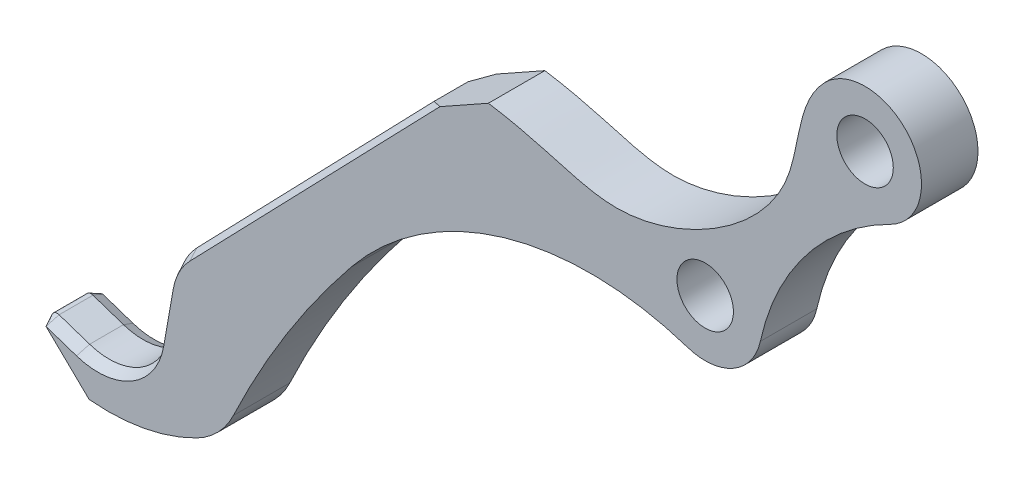
ISO-10303-21;
HEADER;
FILE_DESCRIPTION(('STEP AP214'),'2;1');
FILE_NAME('part.step','',(''),(''),'','','');
FILE_SCHEMA(('AUTOMOTIVE_DESIGN { 1 0 10303 214 1 1 1 1 }'));
ENDSEC;
DATA;
#1=APPLICATION_CONTEXT('core data for automotive mechanical design processes');
#2=APPLICATION_PROTOCOL_DEFINITION('international standard','automotive_design',2000,#1);
#3=PRODUCT_CONTEXT('',#1,'mechanical');
#4=PRODUCT('Part','Part','',(#3));
#5=PRODUCT_RELATED_PRODUCT_CATEGORY('part','',(#4));
#6=PRODUCT_DEFINITION_FORMATION('','',#4);
#7=PRODUCT_DEFINITION_CONTEXT('part definition',#1,'design');
#8=PRODUCT_DEFINITION('design','',#6,#7);
#9=PRODUCT_DEFINITION_SHAPE('','',#8);
#10=(LENGTH_UNIT() NAMED_UNIT(*) SI_UNIT(.MILLI.,.METRE.));
#11=(NAMED_UNIT(*) PLANE_ANGLE_UNIT() SI_UNIT($,.RADIAN.));
#12=(NAMED_UNIT(*) SI_UNIT($,.STERADIAN.) SOLID_ANGLE_UNIT());
#13=UNCERTAINTY_MEASURE_WITH_UNIT(LENGTH_MEASURE(1.E-05),#10,'distance_accuracy_value','');
#14=(GEOMETRIC_REPRESENTATION_CONTEXT(3) GLOBAL_UNCERTAINTY_ASSIGNED_CONTEXT((#13)) GLOBAL_UNIT_ASSIGNED_CONTEXT((#10,
#11,#12)) REPRESENTATION_CONTEXT('',''));
#15=CARTESIAN_POINT('',(0.,0.,0.));
#16=DIRECTION('',(0.,0.,1.));
#17=DIRECTION('',(1.,0.,0.));
#18=AXIS2_PLACEMENT_3D('',#15,#16,#17);
#19=CARTESIAN_POINT('',(35.6569767441861,18.1267760361454,2.5));
#20=DIRECTION('',(0.,0.,1.));
#21=DIRECTION('',(1.,0.,0.));
#22=AXIS2_PLACEMENT_3D('',#19,#20,#21);
#23=PLANE('',#22);
#24=CARTESIAN_POINT('',(21.5,0.,2.5));
#25=DIRECTION('',(0.,0.,1.));
#26=DIRECTION('',(1.,0.,0.));
#27=AXIS2_PLACEMENT_3D('',#24,#25,#26);
#28=CIRCLE('',#27,2.5);
#29=CARTESIAN_POINT('',(24.,0.,2.5));
#30=VERTEX_POINT('',#29);
#31=EDGE_CURVE('E436',#30,#30,#28,.T.);
#32=ORIENTED_EDGE('',*,*,#31,.F.);
#33=EDGE_LOOP('',(#32));
#34=FACE_BOUND('',#33,.T.);
#35=CARTESIAN_POINT('',(35.6569767441861,18.1267760361454,2.5));
#36=DIRECTION('',(0.,0.,1.));
#37=DIRECTION('',(1.,0.,0.));
#38=AXIS2_PLACEMENT_3D('',#35,#36,#37);
#39=CIRCLE('',#38,2.5);
#40=CARTESIAN_POINT('',(38.1569767441861,18.1267760361454,2.5));
#41=VERTEX_POINT('',#40);
#42=EDGE_CURVE('E442',#41,#41,#39,.T.);
#43=ORIENTED_EDGE('',*,*,#42,.F.);
#44=EDGE_LOOP('',(#43));
#45=FACE_BOUND('',#44,.T.);
#46=DIRECTION('',(-0.947903464475991,0.318557721668168,0.));
#47=VECTOR('',#46,1.);
#48=CARTESIAN_POINT('',(13.2966588819159,-48.4088039442666,2.5));
#49=LINE('',#48,#47);
#50=CARTESIAN_POINT('',(-34.1642194941211,-32.4588366211718,2.5));
#51=VERTEX_POINT('',#50);
#52=CARTESIAN_POINT('',(-36.8665647570863,-31.5506714098474,2.5));
#53=VERTEX_POINT('',#52);
#54=EDGE_CURVE('E425',#51,#53,#49,.T.);
#55=ORIENTED_EDGE('',*,*,#54,.T.);
#56=DIRECTION('',(0.719117891816846,-0.694888090032413,0.));
#57=VECTOR('',#56,1.);
#58=CARTESIAN_POINT('',(-24.1865677320025,-43.8034313740248,2.5));
#59=LINE('',#58,#57);
#60=CARTESIAN_POINT('',(-33.0505496340555,-35.2381105495942,2.5));
#61=VERTEX_POINT('',#60);
#62=EDGE_CURVE('E422',#53,#61,#59,.T.);
#63=ORIENTED_EDGE('',*,*,#62,.T.);
#64=CARTESIAN_POINT('',(-31.3549129933605,-18.1276992039203,2.5));
#65=DIRECTION('',(0.,0.,1.));
#66=DIRECTION('',(-1.,0.,0.));
#67=AXIS2_PLACEMENT_3D('',#64,#65,#66);
#68=CIRCLE('',#67,17.1942246128004);
#69=CARTESIAN_POINT('',(-23.5206765828774,-33.4334530207075,2.5));
#70=VERTEX_POINT('',#69);
#71=EDGE_CURVE('E483',#61,#70,#68,.T.);
#72=ORIENTED_EDGE('',*,*,#71,.T.);
#73=CARTESIAN_POINT('',(-26.8158115388646,-26.9957452739855,2.5));
#74=DIRECTION('',(0.,0.,1.));
#75=DIRECTION('',(-1.,0.,0.));
#76=AXIS2_PLACEMENT_3D('',#73,#74,#75);
#77=CIRCLE('',#76,7.23201185081802);
#78=CARTESIAN_POINT('',(-20.2786402625582,-30.0888645918599,2.5));
#79=VERTEX_POINT('',#78);
#80=EDGE_CURVE('E224',#70,#79,#77,.T.);
#81=ORIENTED_EDGE('',*,*,#80,.T.);
#82=CARTESIAN_POINT('',(54.3335205851231,-65.3922559689176,2.5));
#83=DIRECTION('',(0.,0.,-1.));
#84=DIRECTION('',(1.,0.,0.));
#85=AXIS2_PLACEMENT_3D('',#82,#83,#84);
#86=CIRCLE('',#85,82.5427403778307);
#87=CARTESIAN_POINT('',(-9.85122890348396,-13.4921411119471,2.5));
#88=VERTEX_POINT('',#87);
#89=EDGE_CURVE('E219',#79,#88,#86,.T.);
#90=ORIENTED_EDGE('',*,*,#89,.T.);
#91=CARTESIAN_POINT('',(11.3596678332938,-30.6433800842752,2.5));
#92=DIRECTION('',(0.,0.,-1.));
#93=DIRECTION('',(1.,0.,0.));
#94=AXIS2_PLACEMENT_3D('',#91,#92,#93);
#95=CIRCLE('',#94,27.2775940776337);
#96=CARTESIAN_POINT('',(19.9291995025533,-4.74685009213697,2.5));
#97=VERTEX_POINT('',#96);
#98=EDGE_CURVE('E385',#88,#97,#95,.T.);
#99=ORIENTED_EDGE('',*,*,#98,.T.);
#100=CARTESIAN_POINT('',(21.5,0.,2.5));
#101=DIRECTION('',(0.,0.,1.));
#102=DIRECTION('',(1.,0.,0.));
#103=AXIS2_PLACEMENT_3D('',#100,#101,#102);
#104=CIRCLE('',#103,5.);
#105=CARTESIAN_POINT('',(26.3838947978595,-1.07124768538378,2.5));
#106=VERTEX_POINT('',#105);
#107=EDGE_CURVE('E209',#97,#106,#104,.T.);
#108=ORIENTED_EDGE('',*,*,#107,.T.);
#109=CARTESIAN_POINT('',(47.4797739300382,-5.6984791526518,2.5));
#110=DIRECTION('',(0.,0.,-1.));
#111=DIRECTION('',(1.,0.,0.));
#112=AXIS2_PLACEMENT_3D('',#109,#110,#111);
#113=CIRCLE('',#112,21.5973930697935);
#114=CARTESIAN_POINT('',(37.8795248628735,13.6479056584588,2.5));
#115=VERTEX_POINT('',#114);
#116=EDGE_CURVE('E493',#106,#115,#113,.T.);
#117=ORIENTED_EDGE('',*,*,#116,.T.);
#118=CARTESIAN_POINT('',(35.6569767441861,18.1267760361454,2.5));
#119=DIRECTION('',(0.,0.,1.));
#120=DIRECTION('',(1.,0.,0.));
#121=AXIS2_PLACEMENT_3D('',#118,#119,#120);
#122=CIRCLE('',#121,5.00000000000001);
#123=CARTESIAN_POINT('',(32.0722231070795,21.6123952582136,2.5));
#124=VERTEX_POINT('',#123);
#125=EDGE_CURVE('E203',#115,#124,#122,.T.);
#126=ORIENTED_EDGE('',*,*,#125,.T.);
#127=CARTESIAN_POINT('',(32.0722231070795,21.6123952582136,2.5));
#128=CARTESIAN_POINT('',(29.6195530579345,19.0899688773774,2.5));
#129=CARTESIAN_POINT('',(30.5294420981265,9.38410746656572,2.5));
#130=CARTESIAN_POINT('',(14.4971164640885,0.221014353395845,2.5));
#131=CARTESIAN_POINT('',(7.89530238424474,4.29096514264077,2.5));
#132=CARTESIAN_POINT('',(2.30349989155702,5.14788877294363,2.5));
#133=B_SPLINE_CURVE_WITH_KNOTS('',3,(#127,#128,#129,#130,#131,#132),.UNSPECIFIED.,.F.,.F.,(4,1,
1,4),(0.,0.241565863797652,0.691252680707342,1.),.UNSPECIFIED.);
#134=CARTESIAN_POINT('',(2.30349989155702,5.14788877294363,2.5));
#135=VERTEX_POINT('',#134);
#136=EDGE_CURVE('E488',#124,#135,#133,.T.);
#137=ORIENTED_EDGE('',*,*,#136,.T.);
#138=DIRECTION('',(-0.872126126619017,-0.489281124986965,0.));
#139=VECTOR('',#138,1.);
#140=CARTESIAN_POINT('',(2.30349989155702,5.14788877294363,2.5));
#141=LINE('',#140,#139);
#142=CARTESIAN_POINT('',(-1.98615701691018,2.74130090231123,2.5));
#143=VERTEX_POINT('',#142);
#144=EDGE_CURVE('E485',#135,#143,#141,.T.);
#145=ORIENTED_EDGE('',*,*,#144,.T.);
#146=DIRECTION('',(-0.694888090032413,-0.719117891816846,0.));
#147=VECTOR('',#146,1.);
#148=CARTESIAN_POINT('',(23.8787838564705,29.5081170553486,2.5));
#149=LINE('',#148,#147);
#150=CARTESIAN_POINT('',(-24.1395370048738,-20.1845372895893,2.5));
#151=VERTEX_POINT('',#150);
#152=EDGE_CURVE('E433',#143,#151,#149,.T.);
#153=ORIENTED_EDGE('',*,*,#152,.T.);
#154=CARTESIAN_POINT('',(-20.1843885998811,-24.0064217847675,2.5));
#155=DIRECTION('',(0.,0.,1.));
#156=DIRECTION('',(1.,0.,0.));
#157=AXIS2_PLACEMENT_3D('',#154,#155,#156);
#158=CIRCLE('',#157,5.49999999999999);
#159=CARTESIAN_POINT('',(-25.6014291423523,-23.0547539008795,2.5));
#160=VERTEX_POINT('',#159);
#161=EDGE_CURVE('E431',#151,#160,#158,.T.);
#162=ORIENTED_EDGE('',*,*,#161,.T.);
#163=DIRECTION('',(-0.173030524343283,-0.98491646226748,0.));
#164=VECTOR('',#163,1.);
#165=CARTESIAN_POINT('',(-16.7491977487089,27.3335140679731,2.5));
#166=LINE('',#165,#164);
#167=CARTESIAN_POINT('',(-26.4476526964072,-27.8715890362437,2.5));
#168=VERTEX_POINT('',#167);
#169=EDGE_CURVE('E429',#160,#168,#166,.T.);
#170=ORIENTED_EDGE('',*,*,#169,.T.);
#171=CARTESIAN_POINT('',(-32.27835787256,-26.8472483814047,2.5));
#172=DIRECTION('',(0.,0.,1.));
#173=DIRECTION('',(1.,0.,0.));
#174=AXIS2_PLACEMENT_3D('',#171,#172,#173);
#175=CIRCLE('',#174,5.91999971523395);
#176=EDGE_CURVE('E427',#168,#51,#175,.F.);
#177=ORIENTED_EDGE('',*,*,#176,.T.);
#178=EDGE_LOOP('',(#55,#63,#72,#81,#90,#99,#108,#117,#126,#137,#145,#153,#162,#170,#177));
#179=FACE_BOUND('',#178,.T.);
#180=ADVANCED_FACE('F36',(#34,#45,#179),#23,.T.);
#181=CARTESIAN_POINT('',(35.6569767441861,18.1267760361454,-2.5));
#182=DIRECTION('',(0.,0.,1.));
#183=DIRECTION('',(1.,0.,0.));
#184=AXIS2_PLACEMENT_3D('',#181,#182,#183);
#185=PLANE('',#184);
#186=CARTESIAN_POINT('',(21.5,0.,-2.5));
#187=DIRECTION('',(0.,0.,1.));
#188=DIRECTION('',(1.,0.,0.));
#189=AXIS2_PLACEMENT_3D('',#186,#187,#188);
#190=CIRCLE('',#189,2.5);
#191=CARTESIAN_POINT('',(24.,0.,-2.5));
#192=VERTEX_POINT('',#191);
#193=EDGE_CURVE('E439',#192,#192,#190,.T.);
#194=ORIENTED_EDGE('',*,*,#193,.T.);
#195=EDGE_LOOP('',(#194));
#196=FACE_BOUND('',#195,.T.);
#197=CARTESIAN_POINT('',(35.6569767441861,18.1267760361454,-2.5));
#198=DIRECTION('',(0.,0.,1.));
#199=DIRECTION('',(1.,0.,0.));
#200=AXIS2_PLACEMENT_3D('',#197,#198,#199);
#201=CIRCLE('',#200,2.5);
#202=CARTESIAN_POINT('',(38.1569767441861,18.1267760361454,-2.5));
#203=VERTEX_POINT('',#202);
#204=EDGE_CURVE('E445',#203,#203,#201,.T.);
#205=ORIENTED_EDGE('',*,*,#204,.T.);
#206=EDGE_LOOP('',(#205));
#207=FACE_BOUND('',#206,.T.);
#208=CARTESIAN_POINT('',(-31.3549129933605,-18.1276992039203,-2.5));
#209=DIRECTION('',(0.,0.,1.));
#210=DIRECTION('',(-1.,0.,0.));
#211=AXIS2_PLACEMENT_3D('',#208,#209,#210);
#212=CIRCLE('',#211,17.1942246128004);
#213=CARTESIAN_POINT('',(-33.0505496340555,-35.2381105495942,-2.5));
#214=VERTEX_POINT('',#213);
#215=CARTESIAN_POINT('',(-23.5206765828774,-33.4334530207075,-2.5));
#216=VERTEX_POINT('',#215);
#217=EDGE_CURVE('E503',#214,#216,#212,.T.);
#218=ORIENTED_EDGE('',*,*,#217,.F.);
#219=DIRECTION('',(-0.719117891816846,0.694888090032413,0.));
#220=VECTOR('',#219,1.);
#221=CARTESIAN_POINT('',(-36.8665647570863,-31.5506714098474,-2.5));
#222=LINE('',#221,#220);
#223=CARTESIAN_POINT('',(-36.8665647570863,-31.5506714098474,-2.5));
#224=VERTEX_POINT('',#223);
#225=EDGE_CURVE('E365',#214,#224,#222,.T.);
#226=ORIENTED_EDGE('',*,*,#225,.T.);
#227=DIRECTION('',(0.947903464475991,-0.318557721668168,0.));
#228=VECTOR('',#227,1.);
#229=CARTESIAN_POINT('',(-34.1642194941211,-32.4588366211718,-2.5));
#230=LINE('',#229,#228);
#231=CARTESIAN_POINT('',(-34.1642194941211,-32.4588366211718,-2.5));
#232=VERTEX_POINT('',#231);
#233=EDGE_CURVE('E367',#224,#232,#230,.T.);
#234=ORIENTED_EDGE('',*,*,#233,.T.);
#235=CARTESIAN_POINT('',(-32.27835787256,-26.8472483814047,-2.5));
#236=DIRECTION('',(0.,0.,1.));
#237=DIRECTION('',(1.,0.,0.));
#238=AXIS2_PLACEMENT_3D('',#235,#236,#237);
#239=CIRCLE('',#238,5.91999971523395);
#240=CARTESIAN_POINT('',(-26.4476526964072,-27.8715890362437,-2.5));
#241=VERTEX_POINT('',#240);
#242=EDGE_CURVE('E369',#232,#241,#239,.T.);
#243=ORIENTED_EDGE('',*,*,#242,.T.);
#244=DIRECTION('',(0.173030524343283,0.98491646226748,0.));
#245=VECTOR('',#244,1.);
#246=CARTESIAN_POINT('',(-25.6014291423523,-23.0547539008795,-2.5));
#247=LINE('',#246,#245);
#248=CARTESIAN_POINT('',(-25.6014291423523,-23.0547539008795,-2.5));
#249=VERTEX_POINT('',#248);
#250=EDGE_CURVE('E371',#241,#249,#247,.T.);
#251=ORIENTED_EDGE('',*,*,#250,.T.);
#252=CARTESIAN_POINT('',(-20.1843885998811,-24.0064217847675,-2.5));
#253=DIRECTION('',(0.,0.,1.));
#254=DIRECTION('',(1.,0.,0.));
#255=AXIS2_PLACEMENT_3D('',#252,#253,#254);
#256=CIRCLE('',#255,5.5);
#257=CARTESIAN_POINT('',(-24.1395370048738,-20.1845372895893,-2.5));
#258=VERTEX_POINT('',#257);
#259=EDGE_CURVE('E331',#249,#258,#256,.F.);
#260=ORIENTED_EDGE('',*,*,#259,.T.);
#261=DIRECTION('',(0.694888090032413,0.719117891816846,0.));
#262=VECTOR('',#261,1.);
#263=CARTESIAN_POINT('',(-3.14510392792002,1.54194309012861,-2.5));
#264=LINE('',#263,#262);
#265=CARTESIAN_POINT('',(-1.98615701691021,2.74130090231121,-2.5));
#266=VERTEX_POINT('',#265);
#267=EDGE_CURVE('E374',#258,#266,#264,.T.);
#268=ORIENTED_EDGE('',*,*,#267,.T.);
#269=DIRECTION('',(-0.872126126619017,-0.489281124986965,0.));
#270=VECTOR('',#269,1.);
#271=CARTESIAN_POINT('',(2.30349989155702,5.14788877294363,-2.5));
#272=LINE('',#271,#270);
#273=CARTESIAN_POINT('',(2.30349989155702,5.14788877294363,-2.5));
#274=VERTEX_POINT('',#273);
#275=EDGE_CURVE('E232',#274,#266,#272,.T.);
#276=ORIENTED_EDGE('',*,*,#275,.F.);
#277=CARTESIAN_POINT('',(32.0722231070795,21.6123952582136,-2.5));
#278=CARTESIAN_POINT('',(29.6195530579345,19.0899688773774,-2.5));
#279=CARTESIAN_POINT('',(30.5294420981265,9.38410746656572,-2.5));
#280=CARTESIAN_POINT('',(14.4971164640885,0.221014353395845,-2.5));
#281=CARTESIAN_POINT('',(7.89530238424474,4.29096514264077,-2.5));
#282=CARTESIAN_POINT('',(2.30349989155702,5.14788877294363,-2.5));
#283=B_SPLINE_CURVE_WITH_KNOTS('',3,(#277,#278,#279,#280,#281,#282),.UNSPECIFIED.,.F.,.F.,(4,1,
1,4),(0.,0.241565863797652,0.691252680707342,1.),.UNSPECIFIED.);
#284=CARTESIAN_POINT('',(32.0722231070795,21.6123952582136,-2.5));
#285=VERTEX_POINT('',#284);
#286=EDGE_CURVE('E221',#285,#274,#283,.T.);
#287=ORIENTED_EDGE('',*,*,#286,.F.);
#288=CARTESIAN_POINT('',(35.6569767441861,18.1267760361454,-2.5));
#289=DIRECTION('',(0.,0.,1.));
#290=DIRECTION('',(1.,0.,0.));
#291=AXIS2_PLACEMENT_3D('',#288,#289,#290);
#292=CIRCLE('',#291,5.00000000000001);
#293=CARTESIAN_POINT('',(37.8795248628735,13.6479056584588,-2.5));
#294=VERTEX_POINT('',#293);
#295=EDGE_CURVE('E204',#294,#285,#292,.T.);
#296=ORIENTED_EDGE('',*,*,#295,.F.);
#297=CARTESIAN_POINT('',(47.4797739300382,-5.6984791526518,-2.5));
#298=DIRECTION('',(0.,0.,-1.));
#299=DIRECTION('',(1.,0.,0.));
#300=AXIS2_PLACEMENT_3D('',#297,#298,#299);
#301=CIRCLE('',#300,21.5973930697935);
#302=CARTESIAN_POINT('',(26.3838947978595,-1.07124768538378,-2.5));
#303=VERTEX_POINT('',#302);
#304=EDGE_CURVE('E199',#303,#294,#301,.T.);
#305=ORIENTED_EDGE('',*,*,#304,.F.);
#306=CARTESIAN_POINT('',(21.5,0.,-2.5));
#307=DIRECTION('',(0.,0.,1.));
#308=DIRECTION('',(1.,0.,0.));
#309=AXIS2_PLACEMENT_3D('',#306,#307,#308);
#310=CIRCLE('',#309,5.);
#311=CARTESIAN_POINT('',(19.9291995025533,-4.74685009213697,-2.5));
#312=VERTEX_POINT('',#311);
#313=EDGE_CURVE('E191',#312,#303,#310,.T.);
#314=ORIENTED_EDGE('',*,*,#313,.F.);
#315=CARTESIAN_POINT('',(11.3596678332938,-30.6433800842752,-2.5));
#316=DIRECTION('',(0.,0.,-1.));
#317=DIRECTION('',(1.,0.,0.));
#318=AXIS2_PLACEMENT_3D('',#315,#316,#317);
#319=CIRCLE('',#318,27.2775940776337);
#320=CARTESIAN_POINT('',(-9.85122890348396,-13.4921411119471,-2.5));
#321=VERTEX_POINT('',#320);
#322=EDGE_CURVE('E197',#321,#312,#319,.T.);
#323=ORIENTED_EDGE('',*,*,#322,.F.);
#324=CARTESIAN_POINT('',(54.3335205851231,-65.3922559689176,-2.5));
#325=DIRECTION('',(0.,0.,-1.));
#326=DIRECTION('',(1.,0.,0.));
#327=AXIS2_PLACEMENT_3D('',#324,#325,#326);
#328=CIRCLE('',#327,82.5427403778307);
#329=CARTESIAN_POINT('',(-20.2786402625582,-30.0888645918599,-2.5));
#330=VERTEX_POINT('',#329);
#331=EDGE_CURVE('E214',#330,#321,#328,.T.);
#332=ORIENTED_EDGE('',*,*,#331,.F.);
#333=CARTESIAN_POINT('',(-26.8158115388646,-26.9957452739855,-2.5));
#334=DIRECTION('',(0.,0.,1.));
#335=DIRECTION('',(-1.,0.,0.));
#336=AXIS2_PLACEMENT_3D('',#333,#334,#335);
#337=CIRCLE('',#336,7.23201185081802);
#338=EDGE_CURVE('E501',#216,#330,#337,.T.);
#339=ORIENTED_EDGE('',*,*,#338,.F.);
#340=EDGE_LOOP('',(#218,#226,#234,#243,#251,#260,#268,#276,#287,#296,#305,#314,#323,#332,#339));
#341=FACE_BOUND('',#340,.T.);
#342=ADVANCED_FACE('F194',(#196,#207,#341),#185,.F.);
#343=CARTESIAN_POINT('',(35.6569767441861,18.1267760361454,2.5));
#344=DIRECTION('',(0.,0.,-1.));
#345=DIRECTION('',(-1.,0.,0.));
#346=AXIS2_PLACEMENT_3D('',#343,#344,#345);
#347=CYLINDRICAL_SURFACE('',#346,5.00000000000001);
#348=ORIENTED_EDGE('',*,*,#295,.T.);
#349=DIRECTION('',(0.,0.,1.));
#350=VECTOR('',#349,1.);
#351=CARTESIAN_POINT('',(32.0722231070795,21.6123952582136,-2.5));
#352=LINE('',#351,#350);
#353=EDGE_CURVE('E454',#285,#124,#352,.T.);
#354=ORIENTED_EDGE('',*,*,#353,.T.);
#355=ORIENTED_EDGE('',*,*,#125,.F.);
#356=DIRECTION('',(0.,0.,1.));
#357=VECTOR('',#356,1.);
#358=CARTESIAN_POINT('',(37.8795248628735,13.6479056584588,-2.5));
#359=LINE('',#358,#357);
#360=EDGE_CURVE('E451',#294,#115,#359,.T.);
#361=ORIENTED_EDGE('',*,*,#360,.F.);
#362=EDGE_LOOP('',(#348,#354,#355,#361));
#363=FACE_BOUND('',#362,.T.);
#364=ADVANCED_FACE('F266',(#363),#347,.T.);
#365=CARTESIAN_POINT('',(21.5,0.,2.5));
#366=DIRECTION('',(0.,0.,-1.));
#367=DIRECTION('',(-1.,0.,0.));
#368=AXIS2_PLACEMENT_3D('',#365,#366,#367);
#369=CYLINDRICAL_SURFACE('',#368,5.);
#370=ORIENTED_EDGE('',*,*,#313,.T.);
#371=DIRECTION('',(0.,0.,1.));
#372=VECTOR('',#371,1.);
#373=CARTESIAN_POINT('',(26.3838947978595,-1.07124768538378,-2.5));
#374=LINE('',#373,#372);
#375=EDGE_CURVE('E213',#303,#106,#374,.T.);
#376=ORIENTED_EDGE('',*,*,#375,.T.);
#377=ORIENTED_EDGE('',*,*,#107,.F.);
#378=DIRECTION('',(0.,0.,1.));
#379=VECTOR('',#378,1.);
#380=CARTESIAN_POINT('',(19.9291995025533,-4.74685009213697,-2.5));
#381=LINE('',#380,#379);
#382=EDGE_CURVE('E207',#312,#97,#381,.T.);
#383=ORIENTED_EDGE('',*,*,#382,.F.);
#384=EDGE_LOOP('',(#370,#376,#377,#383));
#385=FACE_BOUND('',#384,.T.);
#386=ADVANCED_FACE('F208',(#385),#369,.T.);
#387=CARTESIAN_POINT('',(21.5,0.,2.5));
#388=DIRECTION('',(0.,0.,-1.));
#389=DIRECTION('',(-1.,0.,0.));
#390=AXIS2_PLACEMENT_3D('',#387,#388,#389);
#391=CYLINDRICAL_SURFACE('',#390,2.5);
#392=ORIENTED_EDGE('',*,*,#31,.T.);
#393=EDGE_LOOP('',(#392));
#394=FACE_BOUND('',#393,.T.);
#395=ORIENTED_EDGE('',*,*,#193,.F.);
#396=EDGE_LOOP('',(#395));
#397=FACE_BOUND('',#396,.T.);
#398=ADVANCED_FACE('F256',(#394,#397),#391,.F.);
#399=CARTESIAN_POINT('',(35.6569767441861,18.1267760361454,2.5));
#400=DIRECTION('',(0.,0.,-1.));
#401=DIRECTION('',(-1.,0.,0.));
#402=AXIS2_PLACEMENT_3D('',#399,#400,#401);
#403=CYLINDRICAL_SURFACE('',#402,2.5);
#404=ORIENTED_EDGE('',*,*,#42,.T.);
#405=EDGE_LOOP('',(#404));
#406=FACE_BOUND('',#405,.T.);
#407=ORIENTED_EDGE('',*,*,#204,.F.);
#408=EDGE_LOOP('',(#407));
#409=FACE_BOUND('',#408,.T.);
#410=ADVANCED_FACE('F249',(#406,#409),#403,.F.);
#411=CARTESIAN_POINT('',(47.4797739300382,-5.6984791526518,-2.5));
#412=DIRECTION('',(0.,0.,1.));
#413=DIRECTION('',(1.,0.,0.));
#414=AXIS2_PLACEMENT_3D('',#411,#412,#413);
#415=CYLINDRICAL_SURFACE('',#414,21.5973930697935);
#416=ORIENTED_EDGE('',*,*,#116,.F.);
#417=ORIENTED_EDGE('',*,*,#375,.F.);
#418=ORIENTED_EDGE('',*,*,#304,.T.);
#419=ORIENTED_EDGE('',*,*,#360,.T.);
#420=EDGE_LOOP('',(#416,#417,#418,#419));
#421=FACE_BOUND('',#420,.T.);
#422=ADVANCED_FACE('F246',(#421),#415,.F.);
#423=CARTESIAN_POINT('',(11.3596678332938,-30.6433800842752,-2.5));
#424=DIRECTION('',(0.,0.,1.));
#425=DIRECTION('',(1.,0.,0.));
#426=AXIS2_PLACEMENT_3D('',#423,#424,#425);
#427=CYLINDRICAL_SURFACE('',#426,27.2775940776337);
#428=ORIENTED_EDGE('',*,*,#98,.F.);
#429=DIRECTION('',(0.,0.,1.));
#430=VECTOR('',#429,1.);
#431=CARTESIAN_POINT('',(-9.85122890348396,-13.4921411119471,-2.5));
#432=LINE('',#431,#430);
#433=EDGE_CURVE('E217',#321,#88,#432,.T.);
#434=ORIENTED_EDGE('',*,*,#433,.F.);
#435=ORIENTED_EDGE('',*,*,#322,.T.);
#436=ORIENTED_EDGE('',*,*,#382,.T.);
#437=EDGE_LOOP('',(#428,#434,#435,#436));
#438=FACE_BOUND('',#437,.T.);
#439=ADVANCED_FACE('F216',(#438),#427,.F.);
#440=CARTESIAN_POINT('',(54.3335205851231,-65.3922559689176,-2.5));
#441=DIRECTION('',(0.,0.,1.));
#442=DIRECTION('',(1.,0.,0.));
#443=AXIS2_PLACEMENT_3D('',#440,#441,#442);
#444=CYLINDRICAL_SURFACE('',#443,82.5427403778307);
#445=ORIENTED_EDGE('',*,*,#89,.F.);
#446=DIRECTION('',(0.,0.,1.));
#447=VECTOR('',#446,1.);
#448=CARTESIAN_POINT('',(-20.2786402625582,-30.0888645918599,-2.5));
#449=LINE('',#448,#447);
#450=EDGE_CURVE('E478',#330,#79,#449,.T.);
#451=ORIENTED_EDGE('',*,*,#450,.F.);
#452=ORIENTED_EDGE('',*,*,#331,.T.);
#453=ORIENTED_EDGE('',*,*,#433,.T.);
#454=EDGE_LOOP('',(#445,#451,#452,#453));
#455=FACE_BOUND('',#454,.T.);
#456=ADVANCED_FACE('F253',(#455),#444,.F.);
#457=CARTESIAN_POINT('',(-26.8158115388646,-26.9957452739855,-2.5));
#458=DIRECTION('',(0.,0.,1.));
#459=DIRECTION('',(1.,0.,0.));
#460=AXIS2_PLACEMENT_3D('',#457,#458,#459);
#461=CYLINDRICAL_SURFACE('',#460,7.23201185081802);
#462=ORIENTED_EDGE('',*,*,#80,.F.);
#463=DIRECTION('',(0.,0.,1.));
#464=VECTOR('',#463,1.);
#465=CARTESIAN_POINT('',(-23.5206765828774,-33.4334530207075,-2.5));
#466=LINE('',#465,#464);
#467=EDGE_CURVE('E475',#216,#70,#466,.T.);
#468=ORIENTED_EDGE('',*,*,#467,.F.);
#469=ORIENTED_EDGE('',*,*,#338,.T.);
#470=ORIENTED_EDGE('',*,*,#450,.T.);
#471=EDGE_LOOP('',(#462,#468,#469,#470));
#472=FACE_BOUND('',#471,.T.);
#473=ADVANCED_FACE('F557',(#472),#461,.T.);
#474=CARTESIAN_POINT('',(-31.3549129933605,-18.1276992039203,-2.5));
#475=DIRECTION('',(0.,0.,1.));
#476=DIRECTION('',(1.,0.,0.));
#477=AXIS2_PLACEMENT_3D('',#474,#475,#476);
#478=CYLINDRICAL_SURFACE('',#477,17.1942246128004);
#479=DIRECTION('',(0.,0.,1.));
#480=VECTOR('',#479,1.);
#481=CARTESIAN_POINT('',(-33.8756032275082,-35.136152419275,-2.5));
#482=LINE('',#481,#480);
#483=CARTESIAN_POINT('',(-33.8756032275082,-35.136152419275,-1.49999999999999));
#484=VERTEX_POINT('',#483);
#485=CARTESIAN_POINT('',(-33.8756032275082,-35.136152419275,1.49999999999999));
#486=VERTEX_POINT('',#485);
#487=EDGE_CURVE('E473',#484,#486,#482,.T.);
#488=ORIENTED_EDGE('',*,*,#487,.F.);
#489=CARTESIAN_POINT('',(-31.3549129933605,-18.1276992039203,-29.4653612833237));
#490=DIRECTION('',(-0.62152680242699,-0.643198595975525,-0.447213595499952));
#491=DIRECTION('',(-0.31076340121349,-0.321599297987757,0.894427190999919));
#492=AXIS2_PLACEMENT_3D('',#489,#490,#491);
#493=ELLIPSE('',#492,38.4474550546223,17.1942246128004);
#494=EDGE_CURVE('E376',#484,#214,#493,.F.);
#495=ORIENTED_EDGE('',*,*,#494,.T.);
#496=ORIENTED_EDGE('',*,*,#217,.T.);
#497=ORIENTED_EDGE('',*,*,#467,.T.);
#498=ORIENTED_EDGE('',*,*,#71,.F.);
#499=CARTESIAN_POINT('',(-31.3549129933605,-18.1276992039203,29.4653612833237));
#500=DIRECTION('',(0.62152680242699,0.643198595975525,-0.447213595499952));
#501=DIRECTION('',(0.31076340121349,0.321599297987757,0.894427190999919));
#502=AXIS2_PLACEMENT_3D('',#499,#500,#501);
#503=ELLIPSE('',#502,38.4474550546223,17.1942246128004);
#504=EDGE_CURVE('E419',#61,#486,#503,.T.);
#505=ORIENTED_EDGE('',*,*,#504,.T.);
#506=EDGE_LOOP('',(#488,#495,#496,#497,#498,#505));
#507=FACE_BOUND('',#506,.T.);
#508=ADVANCED_FACE('F559',(#507),#478,.T.);
#509=CARTESIAN_POINT('',(-37.2140088021025,-31.9102303557559,-2.5));
#510=DIRECTION('',(-0.694888090032413,-0.719117891816846,0.));
#511=DIRECTION('',(0.719117891816846,-0.694888090032413,0.));
#512=AXIS2_PLACEMENT_3D('',#509,#510,#511);
#513=PLANE('',#512);
#514=DIRECTION('',(0.,0.,1.));
#515=VECTOR('',#514,1.);
#516=CARTESIAN_POINT('',(-37.2140088021025,-31.9102303557559,-2.5));
#517=LINE('',#516,#515);
#518=CARTESIAN_POINT('',(-37.2140088021025,-31.9102303557559,-1.49999999999999));
#519=VERTEX_POINT('',#518);
#520=CARTESIAN_POINT('',(-37.2140088021025,-31.9102303557559,1.49999999999999));
#521=VERTEX_POINT('',#520);
#522=EDGE_CURVE('E471',#519,#521,#517,.T.);
#523=ORIENTED_EDGE('',*,*,#522,.F.);
#524=DIRECTION('',(0.719117891816846,-0.694888090032413,0.));
#525=VECTOR('',#524,1.);
#526=CARTESIAN_POINT('',(-33.8756032275082,-35.136152419275,-1.49999999999999));
#527=LINE('',#526,#525);
#528=EDGE_CURVE('E378',#519,#484,#527,.T.);
#529=ORIENTED_EDGE('',*,*,#528,.T.);
#530=ORIENTED_EDGE('',*,*,#487,.T.);
#531=DIRECTION('',(-0.719117891816846,0.694888090032413,0.));
#532=VECTOR('',#531,1.);
#533=CARTESIAN_POINT('',(-37.2140088021025,-31.9102303557559,1.49999999999999));
#534=LINE('',#533,#532);
#535=EDGE_CURVE('E416',#486,#521,#534,.T.);
#536=ORIENTED_EDGE('',*,*,#535,.T.);
#537=EDGE_LOOP('',(#523,#529,#530,#536));
#538=FACE_BOUND('',#537,.T.);
#539=ADVANCED_FACE('F564',(#538),#513,.T.);
#540=CARTESIAN_POINT('',(-36.8665647570863,-31.5506714098475,-2.5));
#541=DIRECTION('',(0.,0.,1.));
#542=DIRECTION('',(1.,0.,0.));
#543=AXIS2_PLACEMENT_3D('',#540,#541,#542);
#544=CYLINDRICAL_SURFACE('',#543,0.499999999999999);
#545=DIRECTION('',(0.,0.,1.));
#546=VECTOR('',#545,1.);
#547=CARTESIAN_POINT('',(-36.7072858962522,-31.0767196776095,-2.5));
#548=LINE('',#547,#546);
#549=CARTESIAN_POINT('',(-36.7072858962522,-31.0767196776095,-1.49999999999999));
#550=VERTEX_POINT('',#549);
#551=CARTESIAN_POINT('',(-36.7072858962522,-31.0767196776095,1.49999999999998));
#552=VERTEX_POINT('',#551);
#553=EDGE_CURVE('E469',#550,#552,#548,.T.);
#554=ORIENTED_EDGE('',*,*,#553,.F.);
#555=CARTESIAN_POINT('',(-36.8665647570863,-31.5506714098475,-1.49999999999999));
#556=DIRECTION('',(0.,0.,1.));
#557=DIRECTION('',(1.,0.,0.));
#558=AXIS2_PLACEMENT_3D('',#555,#556,#557);
#559=CIRCLE('',#558,0.499999999999999);
#560=EDGE_CURVE('E363',#550,#519,#559,.T.);
#561=ORIENTED_EDGE('',*,*,#560,.T.);
#562=ORIENTED_EDGE('',*,*,#522,.T.);
#563=CARTESIAN_POINT('',(-36.8665647570863,-31.5506714098475,1.49999999999999));
#564=DIRECTION('',(0.,0.,1.));
#565=DIRECTION('',(1.,0.,0.));
#566=AXIS2_PLACEMENT_3D('',#563,#564,#565);
#567=CIRCLE('',#566,0.499999999999999);
#568=EDGE_CURVE('E413',#521,#552,#567,.F.);
#569=ORIENTED_EDGE('',*,*,#568,.T.);
#570=EDGE_LOOP('',(#554,#561,#562,#569));
#571=FACE_BOUND('',#570,.T.);
#572=ADVANCED_FACE('F567',(#571),#544,.T.);
#573=CARTESIAN_POINT('',(-34.004940633287,-31.9848848889338,-2.5));
#574=DIRECTION('',(0.318557721668168,0.947903464475991,0.));
#575=DIRECTION('',(-0.947903464475991,0.318557721668168,0.));
#576=AXIS2_PLACEMENT_3D('',#573,#574,#575);
#577=PLANE('',#576);
#578=DIRECTION('',(0.,0.,1.));
#579=VECTOR('',#578,1.);
#580=CARTESIAN_POINT('',(-34.004940633287,-31.9848848889338,-2.5));
#581=LINE('',#580,#579);
#582=CARTESIAN_POINT('',(-34.004940633287,-31.9848848889338,-1.49999999999999));
#583=VERTEX_POINT('',#582);
#584=CARTESIAN_POINT('',(-34.004940633287,-31.9848848889338,1.49999999999999));
#585=VERTEX_POINT('',#584);
#586=EDGE_CURVE('E467',#583,#585,#581,.T.);
#587=ORIENTED_EDGE('',*,*,#586,.F.);
#588=DIRECTION('',(-0.947903464475991,0.318557721668168,0.));
#589=VECTOR('',#588,1.);
#590=CARTESIAN_POINT('',(-36.7072858962522,-31.0767196776095,-1.49999999999999));
#591=LINE('',#590,#589);
#592=EDGE_CURVE('E361',#583,#550,#591,.T.);
#593=ORIENTED_EDGE('',*,*,#592,.T.);
#594=ORIENTED_EDGE('',*,*,#553,.T.);
#595=DIRECTION('',(0.947903464475991,-0.318557721668168,0.));
#596=VECTOR('',#595,1.);
#597=CARTESIAN_POINT('',(-34.004940633287,-31.9848848889338,1.49999999999998));
#598=LINE('',#597,#596);
#599=EDGE_CURVE('E410',#552,#585,#598,.T.);
#600=ORIENTED_EDGE('',*,*,#599,.T.);
#601=EDGE_LOOP('',(#587,#593,#594,#600));
#602=FACE_BOUND('',#601,.T.);
#603=ADVANCED_FACE('F519',(#602),#577,.T.);
#604=CARTESIAN_POINT('',(-32.27835787256,-26.8472483814047,-2.5));
#605=DIRECTION('',(0.,0.,1.));
#606=DIRECTION('',(1.,0.,0.));
#607=AXIS2_PLACEMENT_3D('',#604,#605,#606);
#608=CYLINDRICAL_SURFACE('',#607,5.41999971523395);
#609=DIRECTION('',(0.,0.,1.));
#610=VECTOR('',#609,1.);
#611=CARTESIAN_POINT('',(-26.940110927541,-27.7850737740721,-2.5));
#612=LINE('',#611,#610);
#613=CARTESIAN_POINT('',(-26.940110927541,-27.7850737740721,-1.49999999999999));
#614=VERTEX_POINT('',#613);
#615=CARTESIAN_POINT('',(-26.940110927541,-27.7850737740721,1.49999999999998));
#616=VERTEX_POINT('',#615);
#617=EDGE_CURVE('E465',#614,#616,#612,.T.);
#618=ORIENTED_EDGE('',*,*,#617,.F.);
#619=CARTESIAN_POINT('',(-32.27835787256,-26.8472483814047,-1.49999999999999));
#620=DIRECTION('',(0.,0.,1.));
#621=DIRECTION('',(1.,0.,0.));
#622=AXIS2_PLACEMENT_3D('',#619,#620,#621);
#623=CIRCLE('',#622,5.41999971523395);
#624=EDGE_CURVE('E359',#614,#583,#623,.F.);
#625=ORIENTED_EDGE('',*,*,#624,.T.);
#626=ORIENTED_EDGE('',*,*,#586,.T.);
#627=CARTESIAN_POINT('',(-32.27835787256,-26.8472483814047,1.49999999999999));
#628=DIRECTION('',(0.,0.,1.));
#629=DIRECTION('',(1.,0.,0.));
#630=AXIS2_PLACEMENT_3D('',#627,#628,#629);
#631=CIRCLE('',#630,5.41999971523395);
#632=EDGE_CURVE('E407',#585,#616,#631,.T.);
#633=ORIENTED_EDGE('',*,*,#632,.T.);
#634=EDGE_LOOP('',(#618,#625,#626,#633));
#635=FACE_BOUND('',#634,.T.);
#636=ADVANCED_FACE('F517',(#635),#608,.F.);
#637=CARTESIAN_POINT('',(-26.940110927541,-27.7850737740721,-2.5));
#638=DIRECTION('',(-0.98491646226748,0.173030524343283,0.));
#639=DIRECTION('',(-0.173030524343283,-0.98491646226748,0.));
#640=AXIS2_PLACEMENT_3D('',#637,#638,#639);
#641=PLANE('',#640);
#642=DIRECTION('',(0.,0.,1.));
#643=VECTOR('',#642,1.);
#644=CARTESIAN_POINT('',(-26.093887373486,-22.9682386387078,-2.5));
#645=LINE('',#644,#643);
#646=CARTESIAN_POINT('',(-26.093887373486,-22.9682386387078,-1.49999999999999));
#647=VERTEX_POINT('',#646);
#648=CARTESIAN_POINT('',(-26.093887373486,-22.9682386387078,1.49999999999999));
#649=VERTEX_POINT('',#648);
#650=EDGE_CURVE('E463',#647,#649,#645,.T.);
#651=ORIENTED_EDGE('',*,*,#650,.F.);
#652=DIRECTION('',(-0.173030524343283,-0.98491646226748,0.));
#653=VECTOR('',#652,1.);
#654=CARTESIAN_POINT('',(-26.940110927541,-27.7850737740721,-1.49999999999999));
#655=LINE('',#654,#653);
#656=EDGE_CURVE('E357',#647,#614,#655,.T.);
#657=ORIENTED_EDGE('',*,*,#656,.T.);
#658=ORIENTED_EDGE('',*,*,#617,.T.);
#659=DIRECTION('',(0.173030524343283,0.98491646226748,0.));
#660=VECTOR('',#659,1.);
#661=CARTESIAN_POINT('',(-26.940110927541,-27.7850737740721,1.49999999999998));
#662=LINE('',#661,#660);
#663=EDGE_CURVE('E404',#616,#649,#662,.T.);
#664=ORIENTED_EDGE('',*,*,#663,.T.);
#665=EDGE_LOOP('',(#651,#657,#658,#664));
#666=FACE_BOUND('',#665,.T.);
#667=ADVANCED_FACE('F539',(#666),#641,.T.);
#668=CARTESIAN_POINT('',(-20.1843885998811,-24.0064217847675,-2.5));
#669=DIRECTION('',(0.,0.,1.));
#670=DIRECTION('',(1.,0.,0.));
#671=AXIS2_PLACEMENT_3D('',#668,#669,#670);
#672=CYLINDRICAL_SURFACE('',#671,6.);
#673=DIRECTION('',(0.,0.,1.));
#674=VECTOR('',#673,1.);
#675=CARTESIAN_POINT('',(-24.4990959507822,-19.8370932445731,-2.5));
#676=LINE('',#675,#674);
#677=CARTESIAN_POINT('',(-24.4990959507822,-19.8370932445731,-1.49999999999998));
#678=VERTEX_POINT('',#677);
#679=CARTESIAN_POINT('',(-24.4990959507822,-19.8370932445731,1.49999999999997));
#680=VERTEX_POINT('',#679);
#681=EDGE_CURVE('E461',#678,#680,#676,.T.);
#682=ORIENTED_EDGE('',*,*,#681,.F.);
#683=CARTESIAN_POINT('',(-20.1843885998811,-24.0064217847675,-1.49999999999999));
#684=DIRECTION('',(0.,0.,1.));
#685=DIRECTION('',(1.,0.,0.));
#686=AXIS2_PLACEMENT_3D('',#683,#684,#685);
#687=CIRCLE('',#686,6.);
#688=EDGE_CURVE('E333',#678,#647,#687,.T.);
#689=ORIENTED_EDGE('',*,*,#688,.T.);
#690=ORIENTED_EDGE('',*,*,#650,.T.);
#691=CARTESIAN_POINT('',(-20.1843885998811,-24.0064217847675,1.49999999999999));
#692=DIRECTION('',(0.,0.,1.));
#693=DIRECTION('',(1.,0.,0.));
#694=AXIS2_PLACEMENT_3D('',#691,#692,#693);
#695=CIRCLE('',#694,6.);
#696=EDGE_CURVE('E401',#649,#680,#695,.F.);
#697=ORIENTED_EDGE('',*,*,#696,.T.);
#698=EDGE_LOOP('',(#682,#689,#690,#697));
#699=FACE_BOUND('',#698,.T.);
#700=ADVANCED_FACE('F543',(#699),#672,.T.);
#701=CARTESIAN_POINT('',(-3.50466287382844,1.88938713514481,-2.5));
#702=DIRECTION('',(-0.719117891816846,0.694888090032413,0.));
#703=DIRECTION('',(-0.694888090032413,-0.719117891816846,0.));
#704=AXIS2_PLACEMENT_3D('',#701,#702,#703);
#705=PLANE('',#704);
#706=DIRECTION('',(0.,0.,1.));
#707=VECTOR('',#706,1.);
#708=CARTESIAN_POINT('',(-3.50466287382844,1.88938713514481,-2.5));
#709=LINE('',#708,#707);
#710=CARTESIAN_POINT('',(-3.50466287382844,1.88938713514481,-1.49999999999998));
#711=VERTEX_POINT('',#710);
#712=CARTESIAN_POINT('',(-3.50466287382844,1.88938713514481,1.49999999999997));
#713=VERTEX_POINT('',#712);
#714=EDGE_CURVE('E459',#711,#713,#709,.T.);
#715=ORIENTED_EDGE('',*,*,#714,.F.);
#716=DIRECTION('',(-0.694888090032413,-0.719117891816846,0.));
#717=VECTOR('',#716,1.);
#718=CARTESIAN_POINT('',(-24.4990959507822,-19.8370932445731,-1.49999999999998));
#719=LINE('',#718,#717);
#720=EDGE_CURVE('E45',#711,#678,#719,.T.);
#721=ORIENTED_EDGE('',*,*,#720,.T.);
#722=ORIENTED_EDGE('',*,*,#681,.T.);
#723=DIRECTION('',(0.694888090032413,0.719117891816846,0.));
#724=VECTOR('',#723,1.);
#725=CARTESIAN_POINT('',(-3.50466287382844,1.88938713514481,1.49999999999997));
#726=LINE('',#725,#724);
#727=EDGE_CURVE('E398',#680,#713,#726,.T.);
#728=ORIENTED_EDGE('',*,*,#727,.T.);
#729=EDGE_LOOP('',(#715,#721,#722,#728));
#730=FACE_BOUND('',#729,.T.);
#731=ADVANCED_FACE('F546',(#730),#705,.T.);
#732=CARTESIAN_POINT('',(2.30349989155702,5.14788877294363,-2.5));
#733=DIRECTION('',(-0.489281124986965,0.872126126619017,0.));
#734=DIRECTION('',(-0.872126126619017,-0.489281124986965,0.));
#735=AXIS2_PLACEMENT_3D('',#732,#733,#734);
#736=PLANE('',#735);
#737=ORIENTED_EDGE('',*,*,#275,.T.);
#738=DIRECTION('',(-0.75626992833159,-0.424283357686332,0.498035568902205));
#739=VECTOR('',#738,1.);
#740=CARTESIAN_POINT('',(1.23949584612895,4.55096009434076,-4.62422813408543));
#741=LINE('',#740,#739);
#742=EDGE_CURVE('E12',#266,#711,#741,.T.);
#743=ORIENTED_EDGE('',*,*,#742,.T.);
#744=ORIENTED_EDGE('',*,*,#714,.T.);
#745=DIRECTION('',(-0.75626992833159,-0.424283357686332,-0.498035568902205));
#746=VECTOR('',#745,1.);
#747=CARTESIAN_POINT('',(-0.643750773872315,3.49441907723551,3.3840309946267));
#748=LINE('',#747,#746);
#749=EDGE_CURVE('E381',#713,#143,#748,.F.);
#750=ORIENTED_EDGE('',*,*,#749,.T.);
#751=ORIENTED_EDGE('',*,*,#144,.F.);
#752=DIRECTION('',(0.,0.,1.));
#753=VECTOR('',#752,1.);
#754=CARTESIAN_POINT('',(2.30349989155702,5.14788877294363,-2.5));
#755=LINE('',#754,#753);
#756=EDGE_CURVE('E457',#274,#135,#755,.T.);
#757=ORIENTED_EDGE('',*,*,#756,.F.);
#758=EDGE_LOOP('',(#737,#743,#744,#750,#751,#757));
#759=FACE_BOUND('',#758,.T.);
#760=ADVANCED_FACE('F243',(#759),#736,.T.);
#761=DIRECTION('',(0.,0.,1.));
#762=VECTOR('',#761,1.);
#763=SURFACE_OF_LINEAR_EXTRUSION('',#283,#762);
#764=ORIENTED_EDGE('',*,*,#136,.F.);
#765=ORIENTED_EDGE('',*,*,#353,.F.);
#766=ORIENTED_EDGE('',*,*,#286,.T.);
#767=ORIENTED_EDGE('',*,*,#756,.T.);
#768=EDGE_LOOP('',(#764,#765,#766,#767));
#769=FACE_BOUND('',#768,.T.);
#770=ADVANCED_FACE('F238',(#769),#763,.T.);
#771=CARTESIAN_POINT('',(23.8787838564705,29.5081170553486,2.5));
#772=DIRECTION('',(0.643198595975526,-0.621526802426991,-0.447213595499948));
#773=DIRECTION('',(-0.694888090032413,-0.719117891816846,0.));
#774=AXIS2_PLACEMENT_3D('',#771,#772,#773);
#775=PLANE('',#774);
#776=ORIENTED_EDGE('',*,*,#749,.F.);
#777=ORIENTED_EDGE('',*,*,#727,.F.);
#778=DIRECTION('',(-0.321599297987755,0.310763401213488,-0.89442719099992));
#779=VECTOR('',#778,1.);
#780=CARTESIAN_POINT('',(-24.1395370048738,-20.1845372895893,2.5));
#781=LINE('',#780,#779);
#782=EDGE_CURVE('E382',#151,#680,#781,.T.);
#783=ORIENTED_EDGE('',*,*,#782,.F.);
#784=ORIENTED_EDGE('',*,*,#152,.F.);
#785=EDGE_LOOP('',(#776,#777,#783,#784));
#786=FACE_BOUND('',#785,.T.);
#787=ADVANCED_FACE('F242',(#786),#775,.F.);
#788=CARTESIAN_POINT('',(-20.1843885998811,-24.0064217847675,2.5));
#789=DIRECTION('',(0.,0.,-1.));
#790=DIRECTION('',(-1.,0.,0.));
#791=AXIS2_PLACEMENT_3D('',#788,#789,#790);
#792=CONICAL_SURFACE('',#791,5.5,0.463647609000803);
#793=ORIENTED_EDGE('',*,*,#782,.T.);
#794=ORIENTED_EDGE('',*,*,#696,.F.);
#795=DIRECTION('',(-0.440468032357737,0.0773816029228009,-0.894427190999917));
#796=VECTOR('',#795,1.);
#797=CARTESIAN_POINT('',(-25.6014291423523,-23.0547539008795,2.5));
#798=LINE('',#797,#796);
#799=EDGE_CURVE('E386',#160,#649,#798,.T.);
#800=ORIENTED_EDGE('',*,*,#799,.F.);
#801=ORIENTED_EDGE('',*,*,#161,.F.);
#802=EDGE_LOOP('',(#793,#794,#800,#801));
#803=FACE_BOUND('',#802,.T.);
#804=ADVANCED_FACE('F292',(#803),#792,.T.);
#805=CARTESIAN_POINT('',(-16.7491977487089,27.3335140679731,2.5));
#806=DIRECTION('',(0.880936064715478,-0.154763205845605,-0.447213595499955));
#807=DIRECTION('',(-0.173030524343283,-0.98491646226748,0.));
#808=AXIS2_PLACEMENT_3D('',#805,#806,#807);
#809=PLANE('',#808);
#810=ORIENTED_EDGE('',*,*,#799,.T.);
#811=ORIENTED_EDGE('',*,*,#663,.F.);
#812=DIRECTION('',(-0.440468032357734,0.0773816029228009,-0.894427190999918));
#813=VECTOR('',#812,1.);
#814=CARTESIAN_POINT('',(-26.4476526964072,-27.8715890362437,2.5));
#815=LINE('',#814,#813);
#816=EDGE_CURVE('E389',#168,#616,#815,.T.);
#817=ORIENTED_EDGE('',*,*,#816,.F.);
#818=ORIENTED_EDGE('',*,*,#169,.F.);
#819=EDGE_LOOP('',(#810,#811,#817,#818));
#820=FACE_BOUND('',#819,.T.);
#821=ADVANCED_FACE('F288',(#820),#809,.F.);
#822=CARTESIAN_POINT('',(-32.27835787256,-26.8472483814047,2.5));
#823=DIRECTION('',(0.,0.,1.));
#824=DIRECTION('',(1.,0.,0.));
#825=AXIS2_PLACEMENT_3D('',#822,#823,#824);
#826=CONICAL_SURFACE('',#825,5.91999971523395,0.463647609000803);
#827=ORIENTED_EDGE('',*,*,#816,.T.);
#828=ORIENTED_EDGE('',*,*,#632,.F.);
#829=DIRECTION('',(0.142463344081494,0.423915316535173,-0.894427190999917));
#830=VECTOR('',#829,1.);
#831=CARTESIAN_POINT('',(-34.1642194941211,-32.4588366211718,2.5));
#832=LINE('',#831,#830);
#833=EDGE_CURVE('E392',#51,#585,#832,.T.);
#834=ORIENTED_EDGE('',*,*,#833,.F.);
#835=ORIENTED_EDGE('',*,*,#176,.F.);
#836=EDGE_LOOP('',(#827,#828,#834,#835));
#837=FACE_BOUND('',#836,.T.);
#838=ADVANCED_FACE('F284',(#837),#826,.F.);
#839=CARTESIAN_POINT('',(13.2966588819159,-48.4088039442666,2.5));
#840=DIRECTION('',(-0.284926688162996,-0.847830633070358,-0.447213595499939));
#841=DIRECTION('',(-0.947903464475991,0.318557721668168,0.));
#842=AXIS2_PLACEMENT_3D('',#839,#840,#841);
#843=PLANE('',#842);
#844=ORIENTED_EDGE('',*,*,#833,.T.);
#845=ORIENTED_EDGE('',*,*,#599,.F.);
#846=DIRECTION('',(0.142463344081488,0.423915316535156,-0.894427190999926));
#847=VECTOR('',#846,1.);
#848=CARTESIAN_POINT('',(-36.8665647570863,-31.5506714098474,2.5));
#849=LINE('',#848,#847);
#850=EDGE_CURVE('E338',#53,#552,#849,.T.);
#851=ORIENTED_EDGE('',*,*,#850,.F.);
#852=ORIENTED_EDGE('',*,*,#54,.F.);
#853=EDGE_LOOP('',(#844,#845,#851,#852));
#854=FACE_BOUND('',#853,.T.);
#855=ADVANCED_FACE('F280',(#854),#843,.F.);
#856=CARTESIAN_POINT('',(-36.8665647570863,-31.5506714098475,1.49999999999999));
#857=DIRECTION('',(0.,0.,-1.));
#858=DIRECTION('',(-1.,0.,0.));
#859=AXIS2_PLACEMENT_3D('',#856,#857,#858);
#860=CONICAL_SURFACE('',#859,0.500000000000002,0.463647609000802);
#861=ORIENTED_EDGE('',*,*,#850,.T.);
#862=ORIENTED_EDGE('',*,*,#568,.F.);
#863=DIRECTION('',(-0.310763401213507,-0.321599297987773,-0.894427190999907));
#864=VECTOR('',#863,1.);
#865=CARTESIAN_POINT('',(-36.8665647570863,-31.5506714098474,2.5));
#866=LINE('',#865,#864);
#867=EDGE_CURVE('E335',#53,#521,#866,.T.);
#868=ORIENTED_EDGE('',*,*,#867,.F.);
#869=EDGE_LOOP('',(#861,#862,#868));
#870=FACE_BOUND('',#869,.T.);
#871=ADVANCED_FACE('F276',(#870),#860,.T.);
#872=CARTESIAN_POINT('',(-24.1865677320025,-43.8034313740248,2.5));
#873=DIRECTION('',(0.62152680242699,0.643198595975525,-0.447213595499952));
#874=DIRECTION('',(0.719117891816846,-0.694888090032413,0.));
#875=AXIS2_PLACEMENT_3D('',#872,#873,#874);
#876=PLANE('',#875);
#877=ORIENTED_EDGE('',*,*,#867,.T.);
#878=ORIENTED_EDGE('',*,*,#535,.F.);
#879=ORIENTED_EDGE('',*,*,#504,.F.);
#880=ORIENTED_EDGE('',*,*,#62,.F.);
#881=EDGE_LOOP('',(#877,#878,#879,#880));
#882=FACE_BOUND('',#881,.T.);
#883=ADVANCED_FACE('F273',(#882),#876,.F.);
#884=CARTESIAN_POINT('',(-3.50466287382844,1.88938713514481,-1.49999999999999));
#885=DIRECTION('',(-0.643198595975526,0.621526802426991,-0.447213595499948));
#886=DIRECTION('',(0.694888090032413,0.719117891816846,0.));
#887=AXIS2_PLACEMENT_3D('',#884,#885,#886);
#888=PLANE('',#887);
#889=ORIENTED_EDGE('',*,*,#742,.F.);
#890=ORIENTED_EDGE('',*,*,#267,.F.);
#891=DIRECTION('',(0.32159929798775,-0.310763401213486,-0.894427190999923));
#892=VECTOR('',#891,1.);
#893=CARTESIAN_POINT('',(-24.4990959507822,-19.8370932445731,-1.49999999999998));
#894=LINE('',#893,#892);
#895=EDGE_CURVE('E40',#678,#258,#894,.T.);
#896=ORIENTED_EDGE('',*,*,#895,.F.);
#897=ORIENTED_EDGE('',*,*,#720,.F.);
#898=EDGE_LOOP('',(#889,#890,#896,#897));
#899=FACE_BOUND('',#898,.T.);
#900=ADVANCED_FACE('F38',(#899),#888,.T.);
#901=CARTESIAN_POINT('',(-20.1843885998811,-24.0064217847675,-1.49999999999999));
#902=DIRECTION('',(0.,0.,1.));
#903=DIRECTION('',(1.,0.,0.));
#904=AXIS2_PLACEMENT_3D('',#901,#902,#903);
#905=CONICAL_SURFACE('',#904,6.,0.463647609000801);
#906=ORIENTED_EDGE('',*,*,#895,.T.);
#907=ORIENTED_EDGE('',*,*,#259,.F.);
#908=DIRECTION('',(0.440468032357737,-0.0773816029228009,-0.894427190999917));
#909=VECTOR('',#908,1.);
#910=CARTESIAN_POINT('',(-26.093887373486,-22.9682386387078,-1.49999999999999));
#911=LINE('',#910,#909);
#912=EDGE_CURVE('E336',#647,#249,#911,.T.);
#913=ORIENTED_EDGE('',*,*,#912,.F.);
#914=ORIENTED_EDGE('',*,*,#688,.F.);
#915=EDGE_LOOP('',(#906,#907,#913,#914));
#916=FACE_BOUND('',#915,.T.);
#917=ADVANCED_FACE('F318',(#916),#905,.T.);
#918=CARTESIAN_POINT('',(-26.940110927541,-27.7850737740721,-1.49999999999999));
#919=DIRECTION('',(-0.880936064715478,0.154763205845605,-0.447213595499955));
#920=DIRECTION('',(0.173030524343283,0.98491646226748,0.));
#921=AXIS2_PLACEMENT_3D('',#918,#919,#920);
#922=PLANE('',#921);
#923=ORIENTED_EDGE('',*,*,#912,.T.);
#924=ORIENTED_EDGE('',*,*,#250,.F.);
#925=DIRECTION('',(0.440468032357737,-0.0773816029228009,-0.894427190999917));
#926=VECTOR('',#925,1.);
#927=CARTESIAN_POINT('',(-26.940110927541,-27.7850737740721,-1.49999999999999));
#928=LINE('',#927,#926);
#929=EDGE_CURVE('E340',#614,#241,#928,.T.);
#930=ORIENTED_EDGE('',*,*,#929,.F.);
#931=ORIENTED_EDGE('',*,*,#656,.F.);
#932=EDGE_LOOP('',(#923,#924,#930,#931));
#933=FACE_BOUND('',#932,.T.);
#934=ADVANCED_FACE('F315',(#933),#922,.T.);
#935=CARTESIAN_POINT('',(-32.27835787256,-26.8472483814047,-1.49999999999999));
#936=DIRECTION('',(0.,0.,-1.));
#937=DIRECTION('',(-1.,0.,0.));
#938=AXIS2_PLACEMENT_3D('',#935,#936,#937);
#939=CONICAL_SURFACE('',#938,5.41999971523395,0.463647609000803);
#940=ORIENTED_EDGE('',*,*,#929,.T.);
#941=ORIENTED_EDGE('',*,*,#242,.F.);
#942=DIRECTION('',(-0.142463344081494,-0.423915316535173,-0.894427190999917));
#943=VECTOR('',#942,1.);
#944=CARTESIAN_POINT('',(-34.004940633287,-31.9848848889338,-1.49999999999999));
#945=LINE('',#944,#943);
#946=EDGE_CURVE('E344',#583,#232,#945,.T.);
#947=ORIENTED_EDGE('',*,*,#946,.F.);
#948=ORIENTED_EDGE('',*,*,#624,.F.);
#949=EDGE_LOOP('',(#940,#941,#947,#948));
#950=FACE_BOUND('',#949,.T.);
#951=ADVANCED_FACE('F311',(#950),#939,.F.);
#952=CARTESIAN_POINT('',(-34.004940633287,-31.9848848889338,-1.49999999999999));
#953=DIRECTION('',(0.284926688162996,0.847830633070358,-0.447213595499939));
#954=DIRECTION('',(0.947903464475991,-0.318557721668168,0.));
#955=AXIS2_PLACEMENT_3D('',#952,#953,#954);
#956=PLANE('',#955);
#957=DIRECTION('',(-0.142463344081489,-0.423915316535158,-0.894427190999925));
#958=VECTOR('',#957,1.);
#959=CARTESIAN_POINT('',(-36.7072858962522,-31.0767196776095,-1.49999999999999));
#960=LINE('',#959,#958);
#961=EDGE_CURVE('E349',#550,#224,#960,.T.);
#962=ORIENTED_EDGE('',*,*,#961,.F.);
#963=ORIENTED_EDGE('',*,*,#592,.F.);
#964=ORIENTED_EDGE('',*,*,#946,.T.);
#965=ORIENTED_EDGE('',*,*,#233,.F.);
#966=EDGE_LOOP('',(#962,#963,#964,#965));
#967=FACE_BOUND('',#966,.T.);
#968=ADVANCED_FACE('F307',(#967),#956,.T.);
#969=CARTESIAN_POINT('',(-36.8665647570863,-31.5506714098475,-1.49999999999999));
#970=DIRECTION('',(0.,0.,1.));
#971=DIRECTION('',(1.,0.,0.));
#972=AXIS2_PLACEMENT_3D('',#969,#970,#971);
#973=CONICAL_SURFACE('',#972,0.500000000000002,0.463647609000802);
#974=ORIENTED_EDGE('',*,*,#560,.F.);
#975=ORIENTED_EDGE('',*,*,#961,.T.);
#976=DIRECTION('',(0.310763401213507,0.321599297987773,-0.894427190999907));
#977=VECTOR('',#976,1.);
#978=CARTESIAN_POINT('',(-37.2140088021025,-31.9102303557559,-1.49999999999999));
#979=LINE('',#978,#977);
#980=EDGE_CURVE('E352',#519,#224,#979,.T.);
#981=ORIENTED_EDGE('',*,*,#980,.F.);
#982=EDGE_LOOP('',(#974,#975,#981));
#983=FACE_BOUND('',#982,.T.);
#984=ADVANCED_FACE('F303',(#983),#973,.T.);
#985=CARTESIAN_POINT('',(-37.2140088021025,-31.9102303557559,-1.49999999999999));
#986=DIRECTION('',(-0.62152680242699,-0.643198595975525,-0.447213595499952));
#987=DIRECTION('',(-0.719117891816846,0.694888090032413,0.));
#988=AXIS2_PLACEMENT_3D('',#985,#986,#987);
#989=PLANE('',#988);
#990=ORIENTED_EDGE('',*,*,#980,.T.);
#991=ORIENTED_EDGE('',*,*,#225,.F.);
#992=ORIENTED_EDGE('',*,*,#494,.F.);
#993=ORIENTED_EDGE('',*,*,#528,.F.);
#994=EDGE_LOOP('',(#990,#991,#992,#993));
#995=FACE_BOUND('',#994,.T.);
#996=ADVANCED_FACE('F300',(#995),#989,.T.);
#997=CLOSED_SHELL('',(#180,#342,#364,#386,#398,#410,#422,#439,#456,#473,#508,#539,#572,#603,
#636,#667,#700,#731,#760,#770,#787,#804,#821,#838,#855,#871,#883,#900,#917,#934,#951,#968,#984,#996));
#998=MANIFOLD_SOLID_BREP('B2',#997);
#999=ADVANCED_BREP_SHAPE_REPRESENTATION('',(#18,#998),#14);
#1000=SHAPE_DEFINITION_REPRESENTATION(#9,#999);
ENDSEC;
END-ISO-10303-21;
